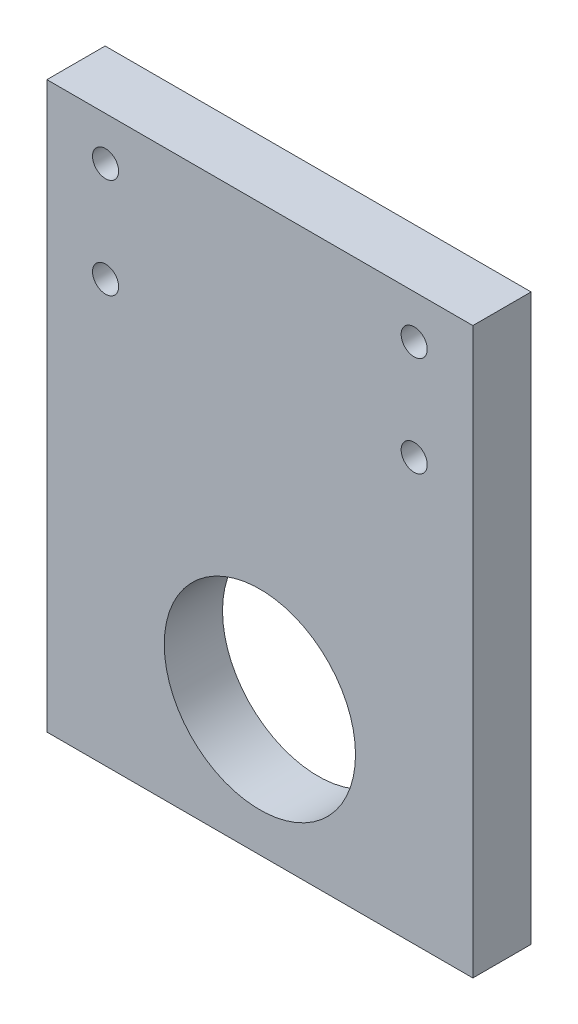
ISO-10303-21;
HEADER;
FILE_DESCRIPTION(('STEP AP214'),'2;1');
FILE_NAME('part.step','',(''),(''),'','','');
FILE_SCHEMA(('AUTOMOTIVE_DESIGN { 1 0 10303 214 1 1 1 1 }'));
ENDSEC;
DATA;
#1=APPLICATION_CONTEXT('core data for automotive mechanical design processes');
#2=APPLICATION_PROTOCOL_DEFINITION('international standard','automotive_design',2000,#1);
#3=PRODUCT_CONTEXT('',#1,'mechanical');
#4=PRODUCT('Part','Part','',(#3));
#5=PRODUCT_RELATED_PRODUCT_CATEGORY('part','',(#4));
#6=PRODUCT_DEFINITION_FORMATION('','',#4);
#7=PRODUCT_DEFINITION_CONTEXT('part definition',#1,'design');
#8=PRODUCT_DEFINITION('design','',#6,#7);
#9=PRODUCT_DEFINITION_SHAPE('','',#8);
#10=(LENGTH_UNIT() NAMED_UNIT(*) SI_UNIT(.MILLI.,.METRE.));
#11=(NAMED_UNIT(*) PLANE_ANGLE_UNIT() SI_UNIT($,.RADIAN.));
#12=(NAMED_UNIT(*) SI_UNIT($,.STERADIAN.) SOLID_ANGLE_UNIT());
#13=UNCERTAINTY_MEASURE_WITH_UNIT(LENGTH_MEASURE(1.E-05),#10,'distance_accuracy_value','');
#14=(GEOMETRIC_REPRESENTATION_CONTEXT(3) GLOBAL_UNCERTAINTY_ASSIGNED_CONTEXT((#13)) GLOBAL_UNIT_ASSIGNED_CONTEXT((#10,
#11,#12)) REPRESENTATION_CONTEXT('',''));
#15=CARTESIAN_POINT('',(0.,0.,0.));
#16=DIRECTION('',(0.,0.,1.));
#17=DIRECTION('',(1.,0.,0.));
#18=AXIS2_PLACEMENT_3D('',#15,#16,#17);
#19=CARTESIAN_POINT('',(0.,0.,6.7));
#20=DIRECTION('',(0.,0.,-1.));
#21=DIRECTION('',(-1.,0.,0.));
#22=AXIS2_PLACEMENT_3D('',#19,#20,#21);
#23=PLANE('',#22);
#24=DIRECTION('',(0.,-1.,0.));
#25=VECTOR('',#24,1.);
#26=CARTESIAN_POINT('',(0.,0.,6.7));
#27=LINE('',#26,#25);
#28=CARTESIAN_POINT('',(0.,65.,6.7));
#29=VERTEX_POINT('',#28);
#30=CARTESIAN_POINT('',(0.,0.,6.7));
#31=VERTEX_POINT('',#30);
#32=EDGE_CURVE('E87',#29,#31,#27,.T.);
#33=ORIENTED_EDGE('',*,*,#32,.T.);
#34=DIRECTION('',(1.,0.,0.));
#35=VECTOR('',#34,1.);
#36=CARTESIAN_POINT('',(0.,0.,6.7));
#37=LINE('',#36,#35);
#38=CARTESIAN_POINT('',(49.,0.,6.7));
#39=VERTEX_POINT('',#38);
#40=EDGE_CURVE('E82',#31,#39,#37,.T.);
#41=ORIENTED_EDGE('',*,*,#40,.T.);
#42=DIRECTION('',(0.,1.,0.));
#43=VECTOR('',#42,1.);
#44=CARTESIAN_POINT('',(49.,0.,6.7));
#45=LINE('',#44,#43);
#46=CARTESIAN_POINT('',(49.,65.,6.7));
#47=VERTEX_POINT('',#46);
#48=EDGE_CURVE('E85',#39,#47,#45,.T.);
#49=ORIENTED_EDGE('',*,*,#48,.T.);
#50=DIRECTION('',(-1.,0.,0.));
#51=VECTOR('',#50,1.);
#52=CARTESIAN_POINT('',(0.,65.,6.7));
#53=LINE('',#52,#51);
#54=EDGE_CURVE('E52',#47,#29,#53,.T.);
#55=ORIENTED_EDGE('',*,*,#54,.T.);
#56=EDGE_LOOP('',(#33,#41,#49,#55));
#57=FACE_BOUND('',#56,.T.);
#58=CARTESIAN_POINT('',(6.75,60.,6.7));
#59=DIRECTION('',(0.,0.,1.));
#60=DIRECTION('',(1.,0.,0.));
#61=AXIS2_PLACEMENT_3D('',#58,#59,#60);
#62=CIRCLE('',#61,1.5);
#63=CARTESIAN_POINT('',(8.25,60.,6.7));
#64=VERTEX_POINT('',#63);
#65=EDGE_CURVE('E102',#64,#64,#62,.T.);
#66=ORIENTED_EDGE('',*,*,#65,.F.);
#67=EDGE_LOOP('',(#66));
#68=FACE_BOUND('',#67,.T.);
#69=CARTESIAN_POINT('',(6.75000000000001,48.5,6.7));
#70=DIRECTION('',(0.,0.,1.));
#71=DIRECTION('',(1.,0.,0.));
#72=AXIS2_PLACEMENT_3D('',#69,#70,#71);
#73=CIRCLE('',#72,1.5);
#74=CARTESIAN_POINT('',(8.25000000000001,48.5,6.7));
#75=VERTEX_POINT('',#74);
#76=EDGE_CURVE('E117',#75,#75,#73,.T.);
#77=ORIENTED_EDGE('',*,*,#76,.F.);
#78=EDGE_LOOP('',(#77));
#79=FACE_BOUND('',#78,.T.);
#80=CARTESIAN_POINT('',(42.25,60.,6.7));
#81=DIRECTION('',(0.,0.,1.));
#82=DIRECTION('',(1.,0.,0.));
#83=AXIS2_PLACEMENT_3D('',#80,#81,#82);
#84=CIRCLE('',#83,1.5);
#85=CARTESIAN_POINT('',(43.75,60.,6.7));
#86=VERTEX_POINT('',#85);
#87=EDGE_CURVE('E123',#86,#86,#84,.T.);
#88=ORIENTED_EDGE('',*,*,#87,.F.);
#89=EDGE_LOOP('',(#88));
#90=FACE_BOUND('',#89,.T.);
#91=CARTESIAN_POINT('',(42.25,48.5,6.7));
#92=DIRECTION('',(0.,0.,1.));
#93=DIRECTION('',(1.,0.,0.));
#94=AXIS2_PLACEMENT_3D('',#91,#92,#93);
#95=CIRCLE('',#94,1.5);
#96=CARTESIAN_POINT('',(43.75,48.5,6.7));
#97=VERTEX_POINT('',#96);
#98=EDGE_CURVE('E129',#97,#97,#95,.T.);
#99=ORIENTED_EDGE('',*,*,#98,.F.);
#100=EDGE_LOOP('',(#99));
#101=FACE_BOUND('',#100,.T.);
#102=CARTESIAN_POINT('',(24.5,15.5,6.7));
#103=DIRECTION('',(0.,0.,1.));
#104=DIRECTION('',(1.,0.,0.));
#105=AXIS2_PLACEMENT_3D('',#102,#103,#104);
#106=CIRCLE('',#105,11.);
#107=CARTESIAN_POINT('',(35.5,15.5,6.7));
#108=VERTEX_POINT('',#107);
#109=EDGE_CURVE('E135',#108,#108,#106,.T.);
#110=ORIENTED_EDGE('',*,*,#109,.F.);
#111=EDGE_LOOP('',(#110));
#112=FACE_BOUND('',#111,.T.);
#113=ADVANCED_FACE('F35',(#57,#68,#79,#90,#101,#112),#23,.F.);
#114=CARTESIAN_POINT('',(0.,0.,0.));
#115=DIRECTION('',(0.,0.,-1.));
#116=DIRECTION('',(-1.,0.,0.));
#117=AXIS2_PLACEMENT_3D('',#114,#115,#116);
#118=PLANE('',#117);
#119=CARTESIAN_POINT('',(42.25,48.5,0.));
#120=DIRECTION('',(0.,0.,1.));
#121=DIRECTION('',(1.,0.,0.));
#122=AXIS2_PLACEMENT_3D('',#119,#120,#121);
#123=CIRCLE('',#122,1.5);
#124=CARTESIAN_POINT('',(43.75,48.5,0.));
#125=VERTEX_POINT('',#124);
#126=EDGE_CURVE('E132',#125,#125,#123,.T.);
#127=ORIENTED_EDGE('',*,*,#126,.T.);
#128=EDGE_LOOP('',(#127));
#129=FACE_BOUND('',#128,.T.);
#130=CARTESIAN_POINT('',(6.75000000000001,48.5,0.));
#131=DIRECTION('',(0.,0.,1.));
#132=DIRECTION('',(1.,0.,0.));
#133=AXIS2_PLACEMENT_3D('',#130,#131,#132);
#134=CIRCLE('',#133,1.5);
#135=CARTESIAN_POINT('',(8.25000000000001,48.5,0.));
#136=VERTEX_POINT('',#135);
#137=EDGE_CURVE('E120',#136,#136,#134,.T.);
#138=ORIENTED_EDGE('',*,*,#137,.T.);
#139=EDGE_LOOP('',(#138));
#140=FACE_BOUND('',#139,.T.);
#141=DIRECTION('',(0.,-1.,0.));
#142=VECTOR('',#141,1.);
#143=CARTESIAN_POINT('',(0.,0.,0.));
#144=LINE('',#143,#142);
#145=CARTESIAN_POINT('',(0.,65.,0.));
#146=VERTEX_POINT('',#145);
#147=CARTESIAN_POINT('',(0.,0.,0.));
#148=VERTEX_POINT('',#147);
#149=EDGE_CURVE('E99',#146,#148,#144,.T.);
#150=ORIENTED_EDGE('',*,*,#149,.F.);
#151=DIRECTION('',(-1.,0.,0.));
#152=VECTOR('',#151,1.);
#153=CARTESIAN_POINT('',(0.,65.,0.));
#154=LINE('',#153,#152);
#155=CARTESIAN_POINT('',(49.,65.,0.));
#156=VERTEX_POINT('',#155);
#157=EDGE_CURVE('E75',#156,#146,#154,.T.);
#158=ORIENTED_EDGE('',*,*,#157,.F.);
#159=DIRECTION('',(0.,1.,0.));
#160=VECTOR('',#159,1.);
#161=CARTESIAN_POINT('',(49.,0.,0.));
#162=LINE('',#161,#160);
#163=CARTESIAN_POINT('',(49.,0.,0.));
#164=VERTEX_POINT('',#163);
#165=EDGE_CURVE('E69',#164,#156,#162,.T.);
#166=ORIENTED_EDGE('',*,*,#165,.F.);
#167=DIRECTION('',(1.,0.,0.));
#168=VECTOR('',#167,1.);
#169=CARTESIAN_POINT('',(0.,0.,0.));
#170=LINE('',#169,#168);
#171=EDGE_CURVE('E91',#148,#164,#170,.T.);
#172=ORIENTED_EDGE('',*,*,#171,.F.);
#173=EDGE_LOOP('',(#150,#158,#166,#172));
#174=FACE_BOUND('',#173,.T.);
#175=CARTESIAN_POINT('',(6.75,60.,0.));
#176=DIRECTION('',(0.,0.,1.));
#177=DIRECTION('',(1.,0.,0.));
#178=AXIS2_PLACEMENT_3D('',#175,#176,#177);
#179=CIRCLE('',#178,1.5);
#180=CARTESIAN_POINT('',(8.25,60.,0.));
#181=VERTEX_POINT('',#180);
#182=EDGE_CURVE('E114',#181,#181,#179,.T.);
#183=ORIENTED_EDGE('',*,*,#182,.T.);
#184=EDGE_LOOP('',(#183));
#185=FACE_BOUND('',#184,.T.);
#186=CARTESIAN_POINT('',(42.25,60.,0.));
#187=DIRECTION('',(0.,0.,1.));
#188=DIRECTION('',(1.,0.,0.));
#189=AXIS2_PLACEMENT_3D('',#186,#187,#188);
#190=CIRCLE('',#189,1.5);
#191=CARTESIAN_POINT('',(43.75,60.,0.));
#192=VERTEX_POINT('',#191);
#193=EDGE_CURVE('E126',#192,#192,#190,.T.);
#194=ORIENTED_EDGE('',*,*,#193,.T.);
#195=EDGE_LOOP('',(#194));
#196=FACE_BOUND('',#195,.T.);
#197=CARTESIAN_POINT('',(24.5,15.5,0.));
#198=DIRECTION('',(0.,0.,1.));
#199=DIRECTION('',(1.,0.,0.));
#200=AXIS2_PLACEMENT_3D('',#197,#198,#199);
#201=CIRCLE('',#200,11.);
#202=CARTESIAN_POINT('',(35.5,15.5,0.));
#203=VERTEX_POINT('',#202);
#204=EDGE_CURVE('E138',#203,#203,#201,.T.);
#205=ORIENTED_EDGE('',*,*,#204,.T.);
#206=EDGE_LOOP('',(#205));
#207=FACE_BOUND('',#206,.T.);
#208=ADVANCED_FACE('F110',(#129,#140,#174,#185,#196,#207),#118,.T.);
#209=CARTESIAN_POINT('',(0.,0.,6.7));
#210=DIRECTION('',(1.,0.,0.));
#211=DIRECTION('',(0.,1.,0.));
#212=AXIS2_PLACEMENT_3D('',#209,#210,#211);
#213=PLANE('',#212);
#214=ORIENTED_EDGE('',*,*,#149,.T.);
#215=DIRECTION('',(0.,0.,-1.));
#216=VECTOR('',#215,1.);
#217=CARTESIAN_POINT('',(0.,0.,6.7));
#218=LINE('',#217,#216);
#219=EDGE_CURVE('E11',#31,#148,#218,.T.);
#220=ORIENTED_EDGE('',*,*,#219,.F.);
#221=ORIENTED_EDGE('',*,*,#32,.F.);
#222=DIRECTION('',(0.,0.,-1.));
#223=VECTOR('',#222,1.);
#224=CARTESIAN_POINT('',(0.,65.,6.7));
#225=LINE('',#224,#223);
#226=EDGE_CURVE('E95',#29,#146,#225,.T.);
#227=ORIENTED_EDGE('',*,*,#226,.T.);
#228=EDGE_LOOP('',(#214,#220,#221,#227));
#229=FACE_BOUND('',#228,.T.);
#230=ADVANCED_FACE('F37',(#229),#213,.F.);
#231=CARTESIAN_POINT('',(0.,0.,6.7));
#232=DIRECTION('',(0.,1.,0.));
#233=DIRECTION('',(0.,0.,1.));
#234=AXIS2_PLACEMENT_3D('',#231,#232,#233);
#235=PLANE('',#234);
#236=ORIENTED_EDGE('',*,*,#171,.T.);
#237=DIRECTION('',(0.,0.,-1.));
#238=VECTOR('',#237,1.);
#239=CARTESIAN_POINT('',(49.,0.,6.7));
#240=LINE('',#239,#238);
#241=EDGE_CURVE('E44',#39,#164,#240,.T.);
#242=ORIENTED_EDGE('',*,*,#241,.F.);
#243=ORIENTED_EDGE('',*,*,#40,.F.);
#244=ORIENTED_EDGE('',*,*,#219,.T.);
#245=EDGE_LOOP('',(#236,#242,#243,#244));
#246=FACE_BOUND('',#245,.T.);
#247=ADVANCED_FACE('F90',(#246),#235,.F.);
#248=CARTESIAN_POINT('',(49.,0.,6.7));
#249=DIRECTION('',(-1.,0.,0.));
#250=DIRECTION('',(0.,-1.,0.));
#251=AXIS2_PLACEMENT_3D('',#248,#249,#250);
#252=PLANE('',#251);
#253=ORIENTED_EDGE('',*,*,#165,.T.);
#254=DIRECTION('',(0.,0.,-1.));
#255=VECTOR('',#254,1.);
#256=CARTESIAN_POINT('',(49.,65.,6.7));
#257=LINE('',#256,#255);
#258=EDGE_CURVE('E92',#47,#156,#257,.T.);
#259=ORIENTED_EDGE('',*,*,#258,.F.);
#260=ORIENTED_EDGE('',*,*,#48,.F.);
#261=ORIENTED_EDGE('',*,*,#241,.T.);
#262=EDGE_LOOP('',(#253,#259,#260,#261));
#263=FACE_BOUND('',#262,.T.);
#264=ADVANCED_FACE('F93',(#263),#252,.F.);
#265=CARTESIAN_POINT('',(0.,65.,6.7));
#266=DIRECTION('',(0.,-1.,0.));
#267=DIRECTION('',(0.,0.,-1.));
#268=AXIS2_PLACEMENT_3D('',#265,#266,#267);
#269=PLANE('',#268);
#270=ORIENTED_EDGE('',*,*,#157,.T.);
#271=ORIENTED_EDGE('',*,*,#226,.F.);
#272=ORIENTED_EDGE('',*,*,#54,.F.);
#273=ORIENTED_EDGE('',*,*,#258,.T.);
#274=EDGE_LOOP('',(#270,#271,#272,#273));
#275=FACE_BOUND('',#274,.T.);
#276=ADVANCED_FACE('F107',(#275),#269,.F.);
#277=CARTESIAN_POINT('',(6.75,60.,6.7));
#278=DIRECTION('',(0.,0.,-1.));
#279=DIRECTION('',(-1.,0.,0.));
#280=AXIS2_PLACEMENT_3D('',#277,#278,#279);
#281=CYLINDRICAL_SURFACE('',#280,1.5);
#282=ORIENTED_EDGE('',*,*,#65,.T.);
#283=EDGE_LOOP('',(#282));
#284=FACE_BOUND('',#283,.T.);
#285=ORIENTED_EDGE('',*,*,#182,.F.);
#286=EDGE_LOOP('',(#285));
#287=FACE_BOUND('',#286,.T.);
#288=ADVANCED_FACE('F155',(#284,#287),#281,.F.);
#289=CARTESIAN_POINT('',(6.75000000000001,48.5,6.7));
#290=DIRECTION('',(0.,0.,-1.));
#291=DIRECTION('',(-1.,0.,0.));
#292=AXIS2_PLACEMENT_3D('',#289,#290,#291);
#293=CYLINDRICAL_SURFACE('',#292,1.5);
#294=ORIENTED_EDGE('',*,*,#76,.T.);
#295=EDGE_LOOP('',(#294));
#296=FACE_BOUND('',#295,.T.);
#297=ORIENTED_EDGE('',*,*,#137,.F.);
#298=EDGE_LOOP('',(#297));
#299=FACE_BOUND('',#298,.T.);
#300=ADVANCED_FACE('F201',(#296,#299),#293,.F.);
#301=CARTESIAN_POINT('',(42.25,60.,6.7));
#302=DIRECTION('',(0.,0.,-1.));
#303=DIRECTION('',(-1.,0.,0.));
#304=AXIS2_PLACEMENT_3D('',#301,#302,#303);
#305=CYLINDRICAL_SURFACE('',#304,1.5);
#306=ORIENTED_EDGE('',*,*,#87,.T.);
#307=EDGE_LOOP('',(#306));
#308=FACE_BOUND('',#307,.T.);
#309=ORIENTED_EDGE('',*,*,#193,.F.);
#310=EDGE_LOOP('',(#309));
#311=FACE_BOUND('',#310,.T.);
#312=ADVANCED_FACE('F209',(#308,#311),#305,.F.);
#313=CARTESIAN_POINT('',(42.25,48.5,6.7));
#314=DIRECTION('',(0.,0.,-1.));
#315=DIRECTION('',(-1.,0.,0.));
#316=AXIS2_PLACEMENT_3D('',#313,#314,#315);
#317=CYLINDRICAL_SURFACE('',#316,1.5);
#318=ORIENTED_EDGE('',*,*,#98,.T.);
#319=EDGE_LOOP('',(#318));
#320=FACE_BOUND('',#319,.T.);
#321=ORIENTED_EDGE('',*,*,#126,.F.);
#322=EDGE_LOOP('',(#321));
#323=FACE_BOUND('',#322,.T.);
#324=ADVANCED_FACE('F217',(#320,#323),#317,.F.);
#325=CARTESIAN_POINT('',(24.5,15.5,6.7));
#326=DIRECTION('',(0.,0.,-1.));
#327=DIRECTION('',(-1.,0.,0.));
#328=AXIS2_PLACEMENT_3D('',#325,#326,#327);
#329=CYLINDRICAL_SURFACE('',#328,11.);
#330=ORIENTED_EDGE('',*,*,#109,.T.);
#331=EDGE_LOOP('',(#330));
#332=FACE_BOUND('',#331,.T.);
#333=ORIENTED_EDGE('',*,*,#204,.F.);
#334=EDGE_LOOP('',(#333));
#335=FACE_BOUND('',#334,.T.);
#336=ADVANCED_FACE('F144',(#332,#335),#329,.F.);
#337=CLOSED_SHELL('',(#113,#208,#230,#247,#264,#276,#288,#300,#312,#324,#336));
#338=MANIFOLD_SOLID_BREP('B2',#337);
#339=ADVANCED_BREP_SHAPE_REPRESENTATION('',(#18,#338),#14);
#340=SHAPE_DEFINITION_REPRESENTATION(#9,#339);
ENDSEC;
END-ISO-10303-21;
